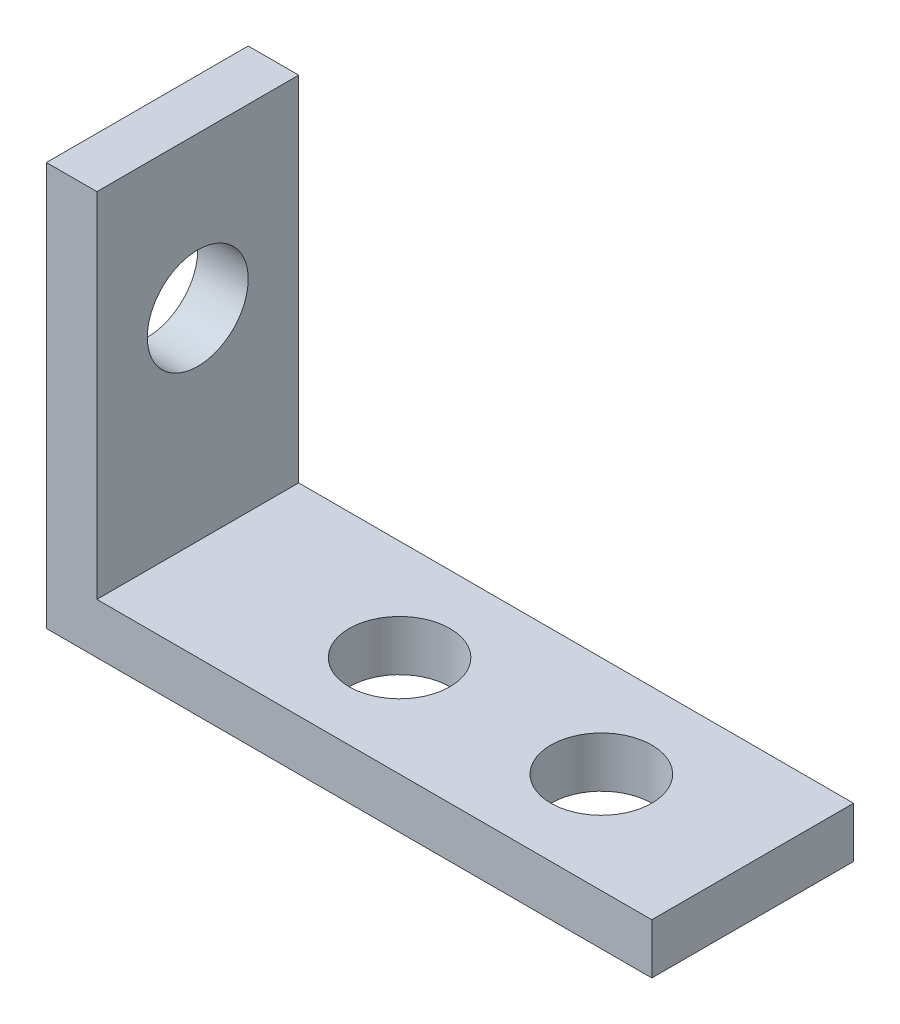
ISO-10303-21;
HEADER;
FILE_DESCRIPTION(('STEP AP214'),'2;1');
FILE_NAME('part.step','',(''),(''),'','','');
FILE_SCHEMA(('AUTOMOTIVE_DESIGN { 1 0 10303 214 1 1 1 1 }'));
ENDSEC;
DATA;
#1=APPLICATION_CONTEXT('core data for automotive mechanical design processes');
#2=APPLICATION_PROTOCOL_DEFINITION('international standard','automotive_design',2000,#1);
#3=PRODUCT_CONTEXT('',#1,'mechanical');
#4=PRODUCT('Part','Part','',(#3));
#5=PRODUCT_RELATED_PRODUCT_CATEGORY('part','',(#4));
#6=PRODUCT_DEFINITION_FORMATION('','',#4);
#7=PRODUCT_DEFINITION_CONTEXT('part definition',#1,'design');
#8=PRODUCT_DEFINITION('design','',#6,#7);
#9=PRODUCT_DEFINITION_SHAPE('','',#8);
#10=(LENGTH_UNIT() NAMED_UNIT(*) SI_UNIT(.MILLI.,.METRE.));
#11=(NAMED_UNIT(*) PLANE_ANGLE_UNIT() SI_UNIT($,.RADIAN.));
#12=(NAMED_UNIT(*) SI_UNIT($,.STERADIAN.) SOLID_ANGLE_UNIT());
#13=UNCERTAINTY_MEASURE_WITH_UNIT(LENGTH_MEASURE(1.E-05),#10,'distance_accuracy_value','');
#14=(GEOMETRIC_REPRESENTATION_CONTEXT(3) GLOBAL_UNCERTAINTY_ASSIGNED_CONTEXT((#13)) GLOBAL_UNIT_ASSIGNED_CONTEXT((#10,
#11,#12)) REPRESENTATION_CONTEXT('',''));
#15=CARTESIAN_POINT('',(0.,0.,0.));
#16=DIRECTION('',(0.,0.,1.));
#17=DIRECTION('',(1.,0.,0.));
#18=AXIS2_PLACEMENT_3D('',#15,#16,#17);
#19=CARTESIAN_POINT('',(38.1,0.,12.7));
#20=DIRECTION('',(0.,1.,0.));
#21=DIRECTION('',(-1.,0.,0.));
#22=AXIS2_PLACEMENT_3D('',#19,#20,#21);
#23=PLANE('',#22);
#24=CARTESIAN_POINT('',(28.575,0.,6.35));
#25=DIRECTION('',(0.,1.,0.));
#26=DIRECTION('',(-1.,0.,0.));
#27=AXIS2_PLACEMENT_3D('',#24,#25,#26);
#28=CIRCLE('',#27,3.175);
#29=CARTESIAN_POINT('',(25.4,0.,6.35));
#30=VERTEX_POINT('',#29);
#31=EDGE_CURVE('E161',#30,#30,#28,.T.);
#32=ORIENTED_EDGE('',*,*,#31,.T.);
#33=EDGE_LOOP('',(#32));
#34=FACE_BOUND('',#33,.T.);
#35=CARTESIAN_POINT('',(15.875,0.,6.35));
#36=DIRECTION('',(0.,1.,0.));
#37=DIRECTION('',(-1.,0.,0.));
#38=AXIS2_PLACEMENT_3D('',#35,#36,#37);
#39=CIRCLE('',#38,3.175);
#40=CARTESIAN_POINT('',(12.7,0.,6.35));
#41=VERTEX_POINT('',#40);
#42=EDGE_CURVE('E119',#41,#41,#39,.T.);
#43=ORIENTED_EDGE('',*,*,#42,.T.);
#44=EDGE_LOOP('',(#43));
#45=FACE_BOUND('',#44,.T.);
#46=DIRECTION('',(1.,0.,0.));
#47=VECTOR('',#46,1.);
#48=CARTESIAN_POINT('',(38.1,0.,0.));
#49=LINE('',#48,#47);
#50=CARTESIAN_POINT('',(0.,0.,0.));
#51=VERTEX_POINT('',#50);
#52=CARTESIAN_POINT('',(38.1,0.,0.));
#53=VERTEX_POINT('',#52);
#54=EDGE_CURVE('E115',#51,#53,#49,.T.);
#55=ORIENTED_EDGE('',*,*,#54,.T.);
#56=DIRECTION('',(0.,0.,-1.));
#57=VECTOR('',#56,1.);
#58=CARTESIAN_POINT('',(38.1,0.,12.7));
#59=LINE('',#58,#57);
#60=CARTESIAN_POINT('',(38.1,0.,12.7));
#61=VERTEX_POINT('',#60);
#62=EDGE_CURVE('E11',#61,#53,#59,.T.);
#63=ORIENTED_EDGE('',*,*,#62,.F.);
#64=DIRECTION('',(1.,0.,0.));
#65=VECTOR('',#64,1.);
#66=CARTESIAN_POINT('',(38.1,0.,12.7));
#67=LINE('',#66,#65);
#68=CARTESIAN_POINT('',(0.,0.,12.7));
#69=VERTEX_POINT('',#68);
#70=EDGE_CURVE('E127',#69,#61,#67,.T.);
#71=ORIENTED_EDGE('',*,*,#70,.F.);
#72=DIRECTION('',(0.,0.,-1.));
#73=VECTOR('',#72,1.);
#74=CARTESIAN_POINT('',(0.,0.,12.7));
#75=LINE('',#74,#73);
#76=EDGE_CURVE('E111',#69,#51,#75,.T.);
#77=ORIENTED_EDGE('',*,*,#76,.T.);
#78=EDGE_LOOP('',(#55,#63,#71,#77));
#79=FACE_BOUND('',#78,.T.);
#80=ADVANCED_FACE('F32',(#34,#45,#79),#23,.F.);
#81=CARTESIAN_POINT('',(38.1,3.175,12.7));
#82=DIRECTION('',(-1.,0.,0.));
#83=DIRECTION('',(0.,0.,1.));
#84=AXIS2_PLACEMENT_3D('',#81,#82,#83);
#85=PLANE('',#84);
#86=DIRECTION('',(0.,1.,0.));
#87=VECTOR('',#86,1.);
#88=CARTESIAN_POINT('',(38.1,3.175,0.));
#89=LINE('',#88,#87);
#90=CARTESIAN_POINT('',(38.1,3.175,0.));
#91=VERTEX_POINT('',#90);
#92=EDGE_CURVE('E118',#53,#91,#89,.T.);
#93=ORIENTED_EDGE('',*,*,#92,.T.);
#94=DIRECTION('',(0.,0.,-1.));
#95=VECTOR('',#94,1.);
#96=CARTESIAN_POINT('',(38.1,3.175,12.7));
#97=LINE('',#96,#95);
#98=CARTESIAN_POINT('',(38.1,3.175,12.7));
#99=VERTEX_POINT('',#98);
#100=EDGE_CURVE('E40',#99,#91,#97,.T.);
#101=ORIENTED_EDGE('',*,*,#100,.F.);
#102=DIRECTION('',(0.,1.,0.));
#103=VECTOR('',#102,1.);
#104=CARTESIAN_POINT('',(38.1,3.175,12.7));
#105=LINE('',#104,#103);
#106=EDGE_CURVE('E82',#61,#99,#105,.T.);
#107=ORIENTED_EDGE('',*,*,#106,.F.);
#108=ORIENTED_EDGE('',*,*,#62,.T.);
#109=EDGE_LOOP('',(#93,#101,#107,#108));
#110=FACE_BOUND('',#109,.T.);
#111=ADVANCED_FACE('F153',(#110),#85,.F.);
#112=CARTESIAN_POINT('',(3.17500000000001,3.175,12.7));
#113=DIRECTION('',(0.,-1.,0.));
#114=DIRECTION('',(1.,0.,0.));
#115=AXIS2_PLACEMENT_3D('',#112,#113,#114);
#116=PLANE('',#115);
#117=CARTESIAN_POINT('',(28.575,3.175,6.35));
#118=DIRECTION('',(0.,1.,0.));
#119=DIRECTION('',(-1.,0.,0.));
#120=AXIS2_PLACEMENT_3D('',#117,#118,#119);
#121=CIRCLE('',#120,3.175);
#122=CARTESIAN_POINT('',(25.4,3.175,6.35));
#123=VERTEX_POINT('',#122);
#124=EDGE_CURVE('E170',#123,#123,#121,.T.);
#125=ORIENTED_EDGE('',*,*,#124,.F.);
#126=EDGE_LOOP('',(#125));
#127=FACE_BOUND('',#126,.T.);
#128=CARTESIAN_POINT('',(15.875,3.175,6.35));
#129=DIRECTION('',(0.,1.,0.));
#130=DIRECTION('',(-1.,0.,0.));
#131=AXIS2_PLACEMENT_3D('',#128,#129,#130);
#132=CIRCLE('',#131,3.175);
#133=CARTESIAN_POINT('',(12.7,3.175,6.35));
#134=VERTEX_POINT('',#133);
#135=EDGE_CURVE('E165',#134,#134,#132,.T.);
#136=ORIENTED_EDGE('',*,*,#135,.F.);
#137=EDGE_LOOP('',(#136));
#138=FACE_BOUND('',#137,.T.);
#139=DIRECTION('',(-1.,0.,0.));
#140=VECTOR('',#139,1.);
#141=CARTESIAN_POINT('',(3.17500000000001,3.175,0.));
#142=LINE('',#141,#140);
#143=CARTESIAN_POINT('',(3.17500000000001,3.175,0.));
#144=VERTEX_POINT('',#143);
#145=EDGE_CURVE('E121',#91,#144,#142,.T.);
#146=ORIENTED_EDGE('',*,*,#145,.T.);
#147=DIRECTION('',(0.,0.,-1.));
#148=VECTOR('',#147,1.);
#149=CARTESIAN_POINT('',(3.17500000000001,3.175,12.7));
#150=LINE('',#149,#148);
#151=CARTESIAN_POINT('',(3.17500000000001,3.175,12.7));
#152=VERTEX_POINT('',#151);
#153=EDGE_CURVE('E107',#152,#144,#150,.T.);
#154=ORIENTED_EDGE('',*,*,#153,.F.);
#155=DIRECTION('',(-1.,0.,0.));
#156=VECTOR('',#155,1.);
#157=CARTESIAN_POINT('',(3.17500000000001,3.175,12.7));
#158=LINE('',#157,#156);
#159=EDGE_CURVE('E95',#99,#152,#158,.T.);
#160=ORIENTED_EDGE('',*,*,#159,.F.);
#161=ORIENTED_EDGE('',*,*,#100,.T.);
#162=EDGE_LOOP('',(#146,#154,#160,#161));
#163=FACE_BOUND('',#162,.T.);
#164=ADVANCED_FACE('F133',(#127,#138,#163),#116,.F.);
#165=CARTESIAN_POINT('',(3.175,25.4,12.7));
#166=DIRECTION('',(-1.,0.,0.));
#167=DIRECTION('',(0.,-1.,0.));
#168=AXIS2_PLACEMENT_3D('',#165,#166,#167);
#169=PLANE('',#168);
#170=CARTESIAN_POINT('',(3.175,15.875,6.35));
#171=DIRECTION('',(1.,0.,0.));
#172=DIRECTION('',(0.,1.,0.));
#173=AXIS2_PLACEMENT_3D('',#170,#171,#172);
#174=CIRCLE('',#173,3.175);
#175=CARTESIAN_POINT('',(3.175,19.05,6.35));
#176=VERTEX_POINT('',#175);
#177=EDGE_CURVE('E177',#176,#176,#174,.T.);
#178=ORIENTED_EDGE('',*,*,#177,.F.);
#179=EDGE_LOOP('',(#178));
#180=FACE_BOUND('',#179,.T.);
#181=DIRECTION('',(0.,1.,0.));
#182=VECTOR('',#181,1.);
#183=CARTESIAN_POINT('',(3.175,25.4,0.));
#184=LINE('',#183,#182);
#185=CARTESIAN_POINT('',(3.175,25.4,0.));
#186=VERTEX_POINT('',#185);
#187=EDGE_CURVE('E104',#144,#186,#184,.T.);
#188=ORIENTED_EDGE('',*,*,#187,.T.);
#189=DIRECTION('',(0.,0.,-1.));
#190=VECTOR('',#189,1.);
#191=CARTESIAN_POINT('',(3.175,25.4,12.7));
#192=LINE('',#191,#190);
#193=CARTESIAN_POINT('',(3.175,25.4,12.7));
#194=VERTEX_POINT('',#193);
#195=EDGE_CURVE('E101',#194,#186,#192,.T.);
#196=ORIENTED_EDGE('',*,*,#195,.F.);
#197=DIRECTION('',(0.,1.,0.));
#198=VECTOR('',#197,1.);
#199=CARTESIAN_POINT('',(3.175,25.4,12.7));
#200=LINE('',#199,#198);
#201=EDGE_CURVE('E89',#152,#194,#200,.T.);
#202=ORIENTED_EDGE('',*,*,#201,.F.);
#203=ORIENTED_EDGE('',*,*,#153,.T.);
#204=EDGE_LOOP('',(#188,#196,#202,#203));
#205=FACE_BOUND('',#204,.T.);
#206=ADVANCED_FACE('F102',(#180,#205),#169,.F.);
#207=CARTESIAN_POINT('',(0.,25.4,12.7));
#208=DIRECTION('',(0.,-1.,0.));
#209=DIRECTION('',(0.,0.,-1.));
#210=AXIS2_PLACEMENT_3D('',#207,#208,#209);
#211=PLANE('',#210);
#212=DIRECTION('',(-1.,0.,0.));
#213=VECTOR('',#212,1.);
#214=CARTESIAN_POINT('',(0.,25.4,0.));
#215=LINE('',#214,#213);
#216=CARTESIAN_POINT('',(0.,25.4,0.));
#217=VERTEX_POINT('',#216);
#218=EDGE_CURVE('E124',#186,#217,#215,.T.);
#219=ORIENTED_EDGE('',*,*,#218,.T.);
#220=DIRECTION('',(0.,0.,-1.));
#221=VECTOR('',#220,1.);
#222=CARTESIAN_POINT('',(0.,25.4,12.7));
#223=LINE('',#222,#221);
#224=CARTESIAN_POINT('',(0.,25.4,12.7));
#225=VERTEX_POINT('',#224);
#226=EDGE_CURVE('E70',#225,#217,#223,.T.);
#227=ORIENTED_EDGE('',*,*,#226,.F.);
#228=DIRECTION('',(-1.,0.,0.));
#229=VECTOR('',#228,1.);
#230=CARTESIAN_POINT('',(0.,25.4,12.7));
#231=LINE('',#230,#229);
#232=EDGE_CURVE('E93',#194,#225,#231,.T.);
#233=ORIENTED_EDGE('',*,*,#232,.F.);
#234=ORIENTED_EDGE('',*,*,#195,.T.);
#235=EDGE_LOOP('',(#219,#227,#233,#234));
#236=FACE_BOUND('',#235,.T.);
#237=ADVANCED_FACE('F109',(#236),#211,.F.);
#238=CARTESIAN_POINT('',(0.,0.,12.7));
#239=DIRECTION('',(1.,0.,0.));
#240=DIRECTION('',(0.,0.,-1.));
#241=AXIS2_PLACEMENT_3D('',#238,#239,#240);
#242=PLANE('',#241);
#243=CARTESIAN_POINT('',(0.,15.875,6.35));
#244=DIRECTION('',(1.,0.,0.));
#245=DIRECTION('',(0.,1.,0.));
#246=AXIS2_PLACEMENT_3D('',#243,#244,#245);
#247=CIRCLE('',#246,3.175);
#248=CARTESIAN_POINT('',(0.,19.05,6.35));
#249=VERTEX_POINT('',#248);
#250=EDGE_CURVE('E175',#249,#249,#247,.T.);
#251=ORIENTED_EDGE('',*,*,#250,.T.);
#252=EDGE_LOOP('',(#251));
#253=FACE_BOUND('',#252,.T.);
#254=DIRECTION('',(0.,-1.,0.));
#255=VECTOR('',#254,1.);
#256=CARTESIAN_POINT('',(0.,0.,0.));
#257=LINE('',#256,#255);
#258=EDGE_CURVE('E74',#217,#51,#257,.T.);
#259=ORIENTED_EDGE('',*,*,#258,.T.);
#260=ORIENTED_EDGE('',*,*,#76,.F.);
#261=DIRECTION('',(0.,-1.,0.));
#262=VECTOR('',#261,1.);
#263=CARTESIAN_POINT('',(0.,0.,12.7));
#264=LINE('',#263,#262);
#265=EDGE_CURVE('E48',#225,#69,#264,.T.);
#266=ORIENTED_EDGE('',*,*,#265,.F.);
#267=ORIENTED_EDGE('',*,*,#226,.T.);
#268=EDGE_LOOP('',(#259,#260,#266,#267));
#269=FACE_BOUND('',#268,.T.);
#270=ADVANCED_FACE('F140',(#253,#269),#242,.F.);
#271=CARTESIAN_POINT('',(0.,0.,12.7));
#272=DIRECTION('',(0.,0.,-1.));
#273=DIRECTION('',(-1.,0.,0.));
#274=AXIS2_PLACEMENT_3D('',#271,#272,#273);
#275=PLANE('',#274);
#276=ORIENTED_EDGE('',*,*,#70,.T.);
#277=ORIENTED_EDGE('',*,*,#106,.T.);
#278=ORIENTED_EDGE('',*,*,#159,.T.);
#279=ORIENTED_EDGE('',*,*,#201,.T.);
#280=ORIENTED_EDGE('',*,*,#232,.T.);
#281=ORIENTED_EDGE('',*,*,#265,.T.);
#282=EDGE_LOOP('',(#276,#277,#278,#279,#280,#281));
#283=FACE_BOUND('',#282,.T.);
#284=ADVANCED_FACE('F91',(#283),#275,.F.);
#285=CARTESIAN_POINT('',(0.,0.,0.));
#286=DIRECTION('',(0.,0.,-1.));
#287=DIRECTION('',(-1.,0.,0.));
#288=AXIS2_PLACEMENT_3D('',#285,#286,#287);
#289=PLANE('',#288);
#290=ORIENTED_EDGE('',*,*,#54,.F.);
#291=ORIENTED_EDGE('',*,*,#258,.F.);
#292=ORIENTED_EDGE('',*,*,#218,.F.);
#293=ORIENTED_EDGE('',*,*,#187,.F.);
#294=ORIENTED_EDGE('',*,*,#145,.F.);
#295=ORIENTED_EDGE('',*,*,#92,.F.);
#296=EDGE_LOOP('',(#290,#291,#292,#293,#294,#295));
#297=FACE_BOUND('',#296,.T.);
#298=ADVANCED_FACE('F136',(#297),#289,.T.);
#299=CARTESIAN_POINT('',(15.875,0.,6.35));
#300=DIRECTION('',(0.,1.,0.));
#301=DIRECTION('',(-1.,0.,0.));
#302=AXIS2_PLACEMENT_3D('',#299,#300,#301);
#303=CYLINDRICAL_SURFACE('',#302,3.175);
#304=ORIENTED_EDGE('',*,*,#42,.F.);
#305=EDGE_LOOP('',(#304));
#306=FACE_BOUND('',#305,.T.);
#307=ORIENTED_EDGE('',*,*,#135,.T.);
#308=EDGE_LOOP('',(#307));
#309=FACE_BOUND('',#308,.T.);
#310=ADVANCED_FACE('F202',(#306,#309),#303,.F.);
#311=CARTESIAN_POINT('',(28.575,0.,6.35));
#312=DIRECTION('',(0.,1.,0.));
#313=DIRECTION('',(-1.,0.,0.));
#314=AXIS2_PLACEMENT_3D('',#311,#312,#313);
#315=CYLINDRICAL_SURFACE('',#314,3.175);
#316=ORIENTED_EDGE('',*,*,#31,.F.);
#317=EDGE_LOOP('',(#316));
#318=FACE_BOUND('',#317,.T.);
#319=ORIENTED_EDGE('',*,*,#124,.T.);
#320=EDGE_LOOP('',(#319));
#321=FACE_BOUND('',#320,.T.);
#322=ADVANCED_FACE('F185',(#318,#321),#315,.F.);
#323=CARTESIAN_POINT('',(0.,15.875,6.35));
#324=DIRECTION('',(1.,0.,0.));
#325=DIRECTION('',(0.,1.,0.));
#326=AXIS2_PLACEMENT_3D('',#323,#324,#325);
#327=CYLINDRICAL_SURFACE('',#326,3.175);
#328=ORIENTED_EDGE('',*,*,#250,.F.);
#329=EDGE_LOOP('',(#328));
#330=FACE_BOUND('',#329,.T.);
#331=ORIENTED_EDGE('',*,*,#177,.T.);
#332=EDGE_LOOP('',(#331));
#333=FACE_BOUND('',#332,.T.);
#334=ADVANCED_FACE('F182',(#330,#333),#327,.F.);
#335=CLOSED_SHELL('',(#80,#111,#164,#206,#237,#270,#284,#298,#310,#322,#334));
#336=MANIFOLD_SOLID_BREP('B2',#335);
#337=ADVANCED_BREP_SHAPE_REPRESENTATION('',(#18,#336),#14);
#338=SHAPE_DEFINITION_REPRESENTATION(#9,#337);
ENDSEC;
END-ISO-10303-21;
